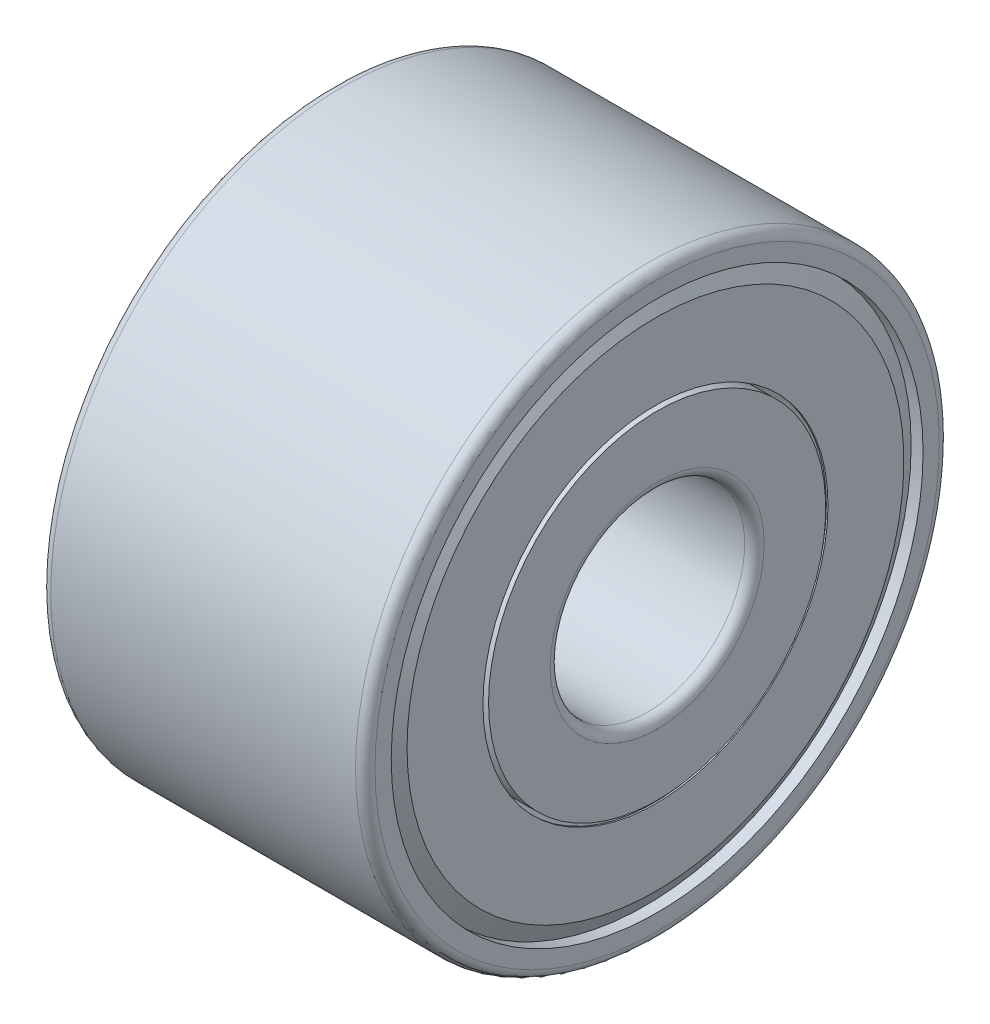
ISO-10303-21;
HEADER;
FILE_DESCRIPTION(('STEP AP214'),'2;1');
FILE_NAME('part.step','',(''),(''),'','','');
FILE_SCHEMA(('AUTOMOTIVE_DESIGN { 1 0 10303 214 1 1 1 1 }'));
ENDSEC;
DATA;
#1=APPLICATION_CONTEXT('core data for automotive mechanical design processes');
#2=APPLICATION_PROTOCOL_DEFINITION('international standard','automotive_design',2000,#1);
#3=PRODUCT_CONTEXT('',#1,'mechanical');
#4=PRODUCT('Part','Part','',(#3));
#5=PRODUCT_RELATED_PRODUCT_CATEGORY('part','',(#4));
#6=PRODUCT_DEFINITION_FORMATION('','',#4);
#7=PRODUCT_DEFINITION_CONTEXT('part definition',#1,'design');
#8=PRODUCT_DEFINITION('design','',#6,#7);
#9=PRODUCT_DEFINITION_SHAPE('','',#8);
#10=(LENGTH_UNIT() NAMED_UNIT(*) SI_UNIT(.MILLI.,.METRE.));
#11=(NAMED_UNIT(*) PLANE_ANGLE_UNIT() SI_UNIT($,.RADIAN.));
#12=(NAMED_UNIT(*) SI_UNIT($,.STERADIAN.) SOLID_ANGLE_UNIT());
#13=UNCERTAINTY_MEASURE_WITH_UNIT(LENGTH_MEASURE(1.E-05),#10,'distance_accuracy_value','');
#14=(GEOMETRIC_REPRESENTATION_CONTEXT(3) GLOBAL_UNCERTAINTY_ASSIGNED_CONTEXT((#13)) GLOBAL_UNIT_ASSIGNED_CONTEXT((#10,
#11,#12)) REPRESENTATION_CONTEXT('',''));
#15=CARTESIAN_POINT('',(0.,0.,0.));
#16=DIRECTION('',(0.,0.,1.));
#17=DIRECTION('',(1.,0.,0.));
#18=AXIS2_PLACEMENT_3D('',#15,#16,#17);
#19=CARTESIAN_POINT('',(4.,0.,0.));
#20=DIRECTION('',(-1.,0.,0.));
#21=DIRECTION('',(0.,0.,1.));
#22=AXIS2_PLACEMENT_3D('',#19,#20,#21);
#23=CYLINDRICAL_SURFACE('',#22,2.6);
#24=CARTESIAN_POINT('',(4.,0.,0.));
#25=DIRECTION('',(-1.,0.,0.));
#26=DIRECTION('',(0.,0.,1.));
#27=AXIS2_PLACEMENT_3D('',#24,#25,#26);
#28=CIRCLE('',#27,2.6);
#29=CARTESIAN_POINT('',(4.,0.,2.6));
#30=VERTEX_POINT('',#29);
#31=EDGE_CURVE('E10',#30,#30,#28,.T.);
#32=ORIENTED_EDGE('',*,*,#31,.T.);
#33=EDGE_LOOP('',(#32));
#34=FACE_BOUND('',#33,.T.);
#35=CARTESIAN_POINT('',(3.11246098558306,0.,0.));
#36=DIRECTION('',(-1.,0.,0.));
#37=DIRECTION('',(0.,0.,1.));
#38=AXIS2_PLACEMENT_3D('',#35,#36,#37);
#39=CIRCLE('',#38,2.6);
#40=CARTESIAN_POINT('',(3.11246098558306,0.,2.6));
#41=VERTEX_POINT('',#40);
#42=EDGE_CURVE('E146',#41,#41,#39,.T.);
#43=ORIENTED_EDGE('',*,*,#42,.F.);
#44=EDGE_LOOP('',(#43));
#45=FACE_BOUND('',#44,.T.);
#46=ADVANCED_FACE('F37',(#34,#45),#23,.T.);
#47=CARTESIAN_POINT('',(4.,2.6,0.));
#48=DIRECTION('',(1.,0.,0.));
#49=DIRECTION('',(0.,0.,-1.));
#50=AXIS2_PLACEMENT_3D('',#47,#48,#49);
#51=PLANE('',#50);
#52=CARTESIAN_POINT('',(4.,0.,0.));
#53=DIRECTION('',(-1.,0.,0.));
#54=DIRECTION('',(0.,0.,1.));
#55=AXIS2_PLACEMENT_3D('',#52,#53,#54);
#56=CIRCLE('',#55,1.65);
#57=CARTESIAN_POINT('',(4.,0.,1.65));
#58=VERTEX_POINT('',#57);
#59=EDGE_CURVE('E43',#58,#58,#56,.T.);
#60=ORIENTED_EDGE('',*,*,#59,.T.);
#61=EDGE_LOOP('',(#60));
#62=FACE_BOUND('',#61,.T.);
#63=ORIENTED_EDGE('',*,*,#31,.F.);
#64=EDGE_LOOP('',(#63));
#65=FACE_BOUND('',#64,.T.);
#66=ADVANCED_FACE('F155',(#62,#65),#51,.T.);
#67=CARTESIAN_POINT('',(3.85,0.,0.));
#68=DIRECTION('',(-1.,0.,0.));
#69=DIRECTION('',(0.,0.,1.));
#70=AXIS2_PLACEMENT_3D('',#67,#68,#69);
#71=TOROIDAL_SURFACE('',#70,1.65,0.15);
#72=CARTESIAN_POINT('',(3.85,0.,0.));
#73=DIRECTION('',(-1.,0.,0.));
#74=DIRECTION('',(0.,0.,1.));
#75=AXIS2_PLACEMENT_3D('',#72,#73,#74);
#76=CIRCLE('',#75,1.5);
#77=CARTESIAN_POINT('',(3.85,0.,1.5));
#78=VERTEX_POINT('',#77);
#79=EDGE_CURVE('E47',#78,#78,#76,.T.);
#80=ORIENTED_EDGE('',*,*,#79,.T.);
#81=EDGE_LOOP('',(#80));
#82=FACE_BOUND('',#81,.T.);
#83=ORIENTED_EDGE('',*,*,#59,.F.);
#84=EDGE_LOOP('',(#83));
#85=FACE_BOUND('',#84,.T.);
#86=ADVANCED_FACE('F159',(#82,#85),#71,.T.);
#87=CARTESIAN_POINT('',(4.,0.,0.));
#88=DIRECTION('',(-1.,0.,0.));
#89=DIRECTION('',(0.,0.,1.));
#90=AXIS2_PLACEMENT_3D('',#87,#88,#89);
#91=CYLINDRICAL_SURFACE('',#90,1.5);
#92=CARTESIAN_POINT('',(-0.85,0.,0.));
#93=DIRECTION('',(-1.,0.,0.));
#94=DIRECTION('',(0.,0.,1.));
#95=AXIS2_PLACEMENT_3D('',#92,#93,#94);
#96=CIRCLE('',#95,1.5);
#97=CARTESIAN_POINT('',(-0.85,0.,1.5));
#98=VERTEX_POINT('',#97);
#99=EDGE_CURVE('E51',#98,#98,#96,.T.);
#100=ORIENTED_EDGE('',*,*,#99,.T.);
#101=EDGE_LOOP('',(#100));
#102=FACE_BOUND('',#101,.T.);
#103=ORIENTED_EDGE('',*,*,#79,.F.);
#104=EDGE_LOOP('',(#103));
#105=FACE_BOUND('',#104,.T.);
#106=ADVANCED_FACE('F163',(#102,#105),#91,.F.);
#107=CARTESIAN_POINT('',(-0.85,0.,0.));
#108=DIRECTION('',(-1.,0.,0.));
#109=DIRECTION('',(0.,0.,1.));
#110=AXIS2_PLACEMENT_3D('',#107,#108,#109);
#111=TOROIDAL_SURFACE('',#110,1.65,0.15);
#112=CARTESIAN_POINT('',(-1.,0.,0.));
#113=DIRECTION('',(-1.,0.,0.));
#114=DIRECTION('',(0.,0.,1.));
#115=AXIS2_PLACEMENT_3D('',#112,#113,#114);
#116=CIRCLE('',#115,1.65);
#117=CARTESIAN_POINT('',(-1.,0.,1.65));
#118=VERTEX_POINT('',#117);
#119=EDGE_CURVE('E56',#118,#118,#116,.T.);
#120=ORIENTED_EDGE('',*,*,#119,.T.);
#121=EDGE_LOOP('',(#120));
#122=FACE_BOUND('',#121,.T.);
#123=ORIENTED_EDGE('',*,*,#99,.F.);
#124=EDGE_LOOP('',(#123));
#125=FACE_BOUND('',#124,.T.);
#126=ADVANCED_FACE('F170',(#122,#125),#111,.T.);
#127=CARTESIAN_POINT('',(-1.,2.6,0.));
#128=DIRECTION('',(-1.,0.,0.));
#129=DIRECTION('',(0.,0.,1.));
#130=AXIS2_PLACEMENT_3D('',#127,#128,#129);
#131=PLANE('',#130);
#132=CARTESIAN_POINT('',(-1.,0.,0.));
#133=DIRECTION('',(-1.,0.,0.));
#134=DIRECTION('',(0.,0.,1.));
#135=AXIS2_PLACEMENT_3D('',#132,#133,#134);
#136=CIRCLE('',#135,2.6);
#137=CARTESIAN_POINT('',(-1.,0.,2.6));
#138=VERTEX_POINT('',#137);
#139=EDGE_CURVE('E59',#138,#138,#136,.T.);
#140=ORIENTED_EDGE('',*,*,#139,.T.);
#141=EDGE_LOOP('',(#140));
#142=FACE_BOUND('',#141,.T.);
#143=ORIENTED_EDGE('',*,*,#119,.F.);
#144=EDGE_LOOP('',(#143));
#145=FACE_BOUND('',#144,.T.);
#146=ADVANCED_FACE('F174',(#142,#145),#131,.T.);
#147=CARTESIAN_POINT('',(4.,0.,0.));
#148=DIRECTION('',(-1.,0.,0.));
#149=DIRECTION('',(0.,0.,1.));
#150=AXIS2_PLACEMENT_3D('',#147,#148,#149);
#151=CYLINDRICAL_SURFACE('',#150,2.6);
#152=CARTESIAN_POINT('',(-0.112460985583064,0.,0.));
#153=DIRECTION('',(-1.,0.,0.));
#154=DIRECTION('',(0.,0.,1.));
#155=AXIS2_PLACEMENT_3D('',#152,#153,#154);
#156=CIRCLE('',#155,2.6);
#157=CARTESIAN_POINT('',(-0.112460985583064,0.,2.6));
#158=VERTEX_POINT('',#157);
#159=EDGE_CURVE('E62',#158,#158,#156,.T.);
#160=ORIENTED_EDGE('',*,*,#159,.T.);
#161=EDGE_LOOP('',(#160));
#162=FACE_BOUND('',#161,.T.);
#163=ORIENTED_EDGE('',*,*,#139,.F.);
#164=EDGE_LOOP('',(#163));
#165=FACE_BOUND('',#164,.T.);
#166=ADVANCED_FACE('F178',(#162,#165),#151,.T.);
#167=CARTESIAN_POINT('',(1.,0.,0.));
#168=DIRECTION('',(-1.,0.,0.));
#169=DIRECTION('',(0.,0.,1.));
#170=AXIS2_PLACEMENT_3D('',#167,#168,#169);
#171=TOROIDAL_SURFACE('',#170,3.35,1.34166666666667);
#172=CARTESIAN_POINT('',(-0.245017849046528,0.,0.));
#173=DIRECTION('',(-1.,0.,0.));
#174=DIRECTION('',(0.,0.,1.));
#175=AXIS2_PLACEMENT_3D('',#172,#173,#174);
#176=CIRCLE('',#175,3.85);
#177=CARTESIAN_POINT('',(-0.245017849046528,0.,3.85));
#178=VERTEX_POINT('',#177);
#179=EDGE_CURVE('E65',#178,#178,#176,.T.);
#180=ORIENTED_EDGE('',*,*,#179,.T.);
#181=EDGE_LOOP('',(#180));
#182=FACE_BOUND('',#181,.T.);
#183=ORIENTED_EDGE('',*,*,#159,.F.);
#184=EDGE_LOOP('',(#183));
#185=FACE_BOUND('',#184,.T.);
#186=ADVANCED_FACE('F182',(#182,#185),#171,.T.);
#187=CARTESIAN_POINT('',(4.,0.,0.));
#188=DIRECTION('',(-1.,0.,0.));
#189=DIRECTION('',(0.,0.,1.));
#190=AXIS2_PLACEMENT_3D('',#187,#188,#189);
#191=CYLINDRICAL_SURFACE('',#190,3.85);
#192=CARTESIAN_POINT('',(-0.636363636363635,0.,0.));
#193=DIRECTION('',(-1.,0.,0.));
#194=DIRECTION('',(0.,0.,1.));
#195=AXIS2_PLACEMENT_3D('',#192,#193,#194);
#196=CIRCLE('',#195,3.85);
#197=CARTESIAN_POINT('',(-0.636363636363635,0.,3.85));
#198=VERTEX_POINT('',#197);
#199=EDGE_CURVE('E68',#198,#198,#196,.T.);
#200=ORIENTED_EDGE('',*,*,#199,.T.);
#201=EDGE_LOOP('',(#200));
#202=FACE_BOUND('',#201,.T.);
#203=ORIENTED_EDGE('',*,*,#179,.F.);
#204=EDGE_LOOP('',(#203));
#205=FACE_BOUND('',#204,.T.);
#206=ADVANCED_FACE('F186',(#202,#205),#191,.F.);
#207=CARTESIAN_POINT('',(-0.63636363636363,4.09999999999993,0.));
#208=DIRECTION('',(-1.,0.,0.));
#209=DIRECTION('',(0.,0.,1.));
#210=AXIS2_PLACEMENT_3D('',#207,#208,#209);
#211=PLANE('',#210);
#212=CARTESIAN_POINT('',(-0.636363636363626,0.,0.));
#213=DIRECTION('',(-1.,0.,0.));
#214=DIRECTION('',(0.,0.,1.));
#215=AXIS2_PLACEMENT_3D('',#212,#213,#214);
#216=CIRCLE('',#215,4.09999999999993);
#217=CARTESIAN_POINT('',(-0.636363636363626,0.,4.09999999999993));
#218=VERTEX_POINT('',#217);
#219=EDGE_CURVE('E71',#218,#218,#216,.T.);
#220=ORIENTED_EDGE('',*,*,#219,.T.);
#221=EDGE_LOOP('',(#220));
#222=FACE_BOUND('',#221,.T.);
#223=ORIENTED_EDGE('',*,*,#199,.F.);
#224=EDGE_LOOP('',(#223));
#225=FACE_BOUND('',#224,.T.);
#226=ADVANCED_FACE('F190',(#222,#225),#211,.T.);
#227=CARTESIAN_POINT('',(-0.727272727272719,0.,0.));
#228=DIRECTION('',(-1.,0.,0.));
#229=DIRECTION('',(0.,0.,1.));
#230=AXIS2_PLACEMENT_3D('',#227,#228,#229);
#231=TOROIDAL_SURFACE('',#230,4.09999999999993,0.0909090909090932);
#232=CARTESIAN_POINT('',(-0.740980147437955,0.,0.));
#233=DIRECTION('',(-1.,0.,0.));
#234=DIRECTION('',(0.,0.,1.));
#235=AXIS2_PLACEMENT_3D('',#232,#233,#234);
#236=CIRCLE('',#235,4.18986973596444);
#237=CARTESIAN_POINT('',(-0.740980147437955,0.,4.18986973596444));
#238=VERTEX_POINT('',#237);
#239=EDGE_CURVE('E74',#238,#238,#236,.T.);
#240=ORIENTED_EDGE('',*,*,#239,.T.);
#241=EDGE_LOOP('',(#240));
#242=FACE_BOUND('',#241,.T.);
#243=ORIENTED_EDGE('',*,*,#219,.F.);
#244=EDGE_LOOP('',(#243));
#245=FACE_BOUND('',#244,.T.);
#246=ADVANCED_FACE('F194',(#242,#245),#231,.F.);
#247=CARTESIAN_POINT('',(-0.740980147437955,0.,0.));
#248=DIRECTION('',(-1.,0.,0.));
#249=DIRECTION('',(0.,0.,1.));
#250=AXIS2_PLACEMENT_3D('',#247,#248,#249);
#251=CONICAL_SURFACE('',#250,4.18986973596444,0.523598775598685);
#252=CARTESIAN_POINT('',(-0.738174682452694,0.,0.));
#253=DIRECTION('',(-1.,0.,0.));
#254=DIRECTION('',(0.,0.,1.));
#255=AXIS2_PLACEMENT_3D('',#252,#253,#254);
#256=CIRCLE('',#255,4.18825);
#257=CARTESIAN_POINT('',(-0.738174682452694,0.,4.18825));
#258=VERTEX_POINT('',#257);
#259=EDGE_CURVE('E77',#258,#258,#256,.T.);
#260=ORIENTED_EDGE('',*,*,#259,.T.);
#261=EDGE_LOOP('',(#260));
#262=FACE_BOUND('',#261,.T.);
#263=ORIENTED_EDGE('',*,*,#239,.F.);
#264=EDGE_LOOP('',(#263));
#265=FACE_BOUND('',#264,.T.);
#266=ADVANCED_FACE('F198',(#262,#265),#251,.T.);
#267=CARTESIAN_POINT('',(-0.738174682452694,0.,0.));
#268=DIRECTION('',(1.,0.,0.));
#269=DIRECTION('',(0.,0.,-1.));
#270=AXIS2_PLACEMENT_3D('',#267,#268,#269);
#271=CONICAL_SURFACE('',#270,4.18825,1.0471975511966);
#272=CARTESIAN_POINT('',(-0.949,0.,0.));
#273=DIRECTION('',(-1.,0.,0.));
#274=DIRECTION('',(0.,0.,1.));
#275=AXIS2_PLACEMENT_3D('',#272,#273,#274);
#276=CIRCLE('',#275,3.82308983848623);
#277=CARTESIAN_POINT('',(-0.949,0.,3.82308983848623));
#278=VERTEX_POINT('',#277);
#279=EDGE_CURVE('E80',#278,#278,#276,.T.);
#280=ORIENTED_EDGE('',*,*,#279,.T.);
#281=EDGE_LOOP('',(#280));
#282=FACE_BOUND('',#281,.T.);
#283=ORIENTED_EDGE('',*,*,#259,.F.);
#284=EDGE_LOOP('',(#283));
#285=FACE_BOUND('',#284,.T.);
#286=ADVANCED_FACE('F202',(#282,#285),#271,.F.);
#287=CARTESIAN_POINT('',(-0.949,2.65999999999992,0.));
#288=DIRECTION('',(1.,0.,0.));
#289=DIRECTION('',(0.,0.,-1.));
#290=AXIS2_PLACEMENT_3D('',#287,#288,#289);
#291=PLANE('',#290);
#292=CARTESIAN_POINT('',(-0.948999999999999,0.,0.));
#293=DIRECTION('',(-1.,0.,0.));
#294=DIRECTION('',(0.,0.,1.));
#295=AXIS2_PLACEMENT_3D('',#292,#293,#294);
#296=CIRCLE('',#295,2.65999999999992);
#297=CARTESIAN_POINT('',(-0.948999999999999,0.,2.65999999999992));
#298=VERTEX_POINT('',#297);
#299=EDGE_CURVE('E83',#298,#298,#296,.T.);
#300=ORIENTED_EDGE('',*,*,#299,.T.);
#301=EDGE_LOOP('',(#300));
#302=FACE_BOUND('',#301,.T.);
#303=ORIENTED_EDGE('',*,*,#279,.F.);
#304=EDGE_LOOP('',(#303));
#305=FACE_BOUND('',#304,.T.);
#306=ADVANCED_FACE('F206',(#302,#305),#291,.T.);
#307=CARTESIAN_POINT('',(4.,0.,0.));
#308=DIRECTION('',(-1.,0.,0.));
#309=DIRECTION('',(0.,0.,1.));
#310=AXIS2_PLACEMENT_3D('',#307,#308,#309);
#311=CYLINDRICAL_SURFACE('',#310,2.65999999999992);
#312=CARTESIAN_POINT('',(-0.973999999999983,0.,0.));
#313=DIRECTION('',(-1.,0.,0.));
#314=DIRECTION('',(0.,0.,1.));
#315=AXIS2_PLACEMENT_3D('',#312,#313,#314);
#316=CIRCLE('',#315,2.65999999999992);
#317=CARTESIAN_POINT('',(-0.973999999999983,0.,2.65999999999992));
#318=VERTEX_POINT('',#317);
#319=EDGE_CURVE('E86',#318,#318,#316,.T.);
#320=ORIENTED_EDGE('',*,*,#319,.T.);
#321=EDGE_LOOP('',(#320));
#322=FACE_BOUND('',#321,.T.);
#323=ORIENTED_EDGE('',*,*,#299,.F.);
#324=EDGE_LOOP('',(#323));
#325=FACE_BOUND('',#324,.T.);
#326=ADVANCED_FACE('F210',(#322,#325),#311,.F.);
#327=CARTESIAN_POINT('',(-0.973999999999983,3.82978856829693,0.));
#328=DIRECTION('',(-1.,0.,0.));
#329=DIRECTION('',(0.,0.,1.));
#330=AXIS2_PLACEMENT_3D('',#327,#328,#329);
#331=PLANE('',#330);
#332=CARTESIAN_POINT('',(-0.973999999999983,0.,0.));
#333=DIRECTION('',(-1.,0.,0.));
#334=DIRECTION('',(0.,0.,1.));
#335=AXIS2_PLACEMENT_3D('',#332,#333,#334);
#336=CIRCLE('',#335,3.82978856829693);
#337=CARTESIAN_POINT('',(-0.973999999999983,0.,3.82978856829693));
#338=VERTEX_POINT('',#337);
#339=EDGE_CURVE('E89',#338,#338,#336,.T.);
#340=ORIENTED_EDGE('',*,*,#339,.T.);
#341=EDGE_LOOP('',(#340));
#342=FACE_BOUND('',#341,.T.);
#343=ORIENTED_EDGE('',*,*,#319,.F.);
#344=EDGE_LOOP('',(#343));
#345=FACE_BOUND('',#344,.T.);
#346=ADVANCED_FACE('F214',(#342,#345),#331,.T.);
#347=CARTESIAN_POINT('',(-0.973999999999983,0.,0.));
#348=DIRECTION('',(1.,0.,0.));
#349=DIRECTION('',(0.,0.,-1.));
#350=AXIS2_PLACEMENT_3D('',#347,#348,#349);
#351=CONICAL_SURFACE('',#350,3.82978856829693,1.04117434780133);
#352=CARTESIAN_POINT('',(-0.81581570684173,0.,0.));
#353=DIRECTION('',(-1.,0.,0.));
#354=DIRECTION('',(0.,0.,1.));
#355=AXIS2_PLACEMENT_3D('',#352,#353,#354);
#356=CIRCLE('',#355,4.09999999999993);
#357=CARTESIAN_POINT('',(-0.81581570684173,0.,4.09999999999993));
#358=VERTEX_POINT('',#357);
#359=EDGE_CURVE('E92',#358,#358,#356,.T.);
#360=ORIENTED_EDGE('',*,*,#359,.T.);
#361=EDGE_LOOP('',(#360));
#362=FACE_BOUND('',#361,.T.);
#363=ORIENTED_EDGE('',*,*,#339,.F.);
#364=EDGE_LOOP('',(#363));
#365=FACE_BOUND('',#364,.T.);
#366=ADVANCED_FACE('F218',(#362,#365),#351,.T.);
#367=CARTESIAN_POINT('',(4.,0.,0.));
#368=DIRECTION('',(-1.,0.,0.));
#369=DIRECTION('',(0.,0.,1.));
#370=AXIS2_PLACEMENT_3D('',#367,#368,#369);
#371=CYLINDRICAL_SURFACE('',#370,4.09999999999993);
#372=CARTESIAN_POINT('',(-1.,0.,0.));
#373=DIRECTION('',(-1.,0.,0.));
#374=DIRECTION('',(0.,0.,1.));
#375=AXIS2_PLACEMENT_3D('',#372,#373,#374);
#376=CIRCLE('',#375,4.09999999999993);
#377=CARTESIAN_POINT('',(-1.,0.,4.09999999999993));
#378=VERTEX_POINT('',#377);
#379=EDGE_CURVE('E95',#378,#378,#376,.T.);
#380=ORIENTED_EDGE('',*,*,#379,.T.);
#381=EDGE_LOOP('',(#380));
#382=FACE_BOUND('',#381,.T.);
#383=ORIENTED_EDGE('',*,*,#359,.F.);
#384=EDGE_LOOP('',(#383));
#385=FACE_BOUND('',#384,.T.);
#386=ADVANCED_FACE('F222',(#382,#385),#371,.F.);
#387=CARTESIAN_POINT('',(-1.,4.35,0.));
#388=DIRECTION('',(-1.,0.,0.));
#389=DIRECTION('',(0.,0.,1.));
#390=AXIS2_PLACEMENT_3D('',#387,#388,#389);
#391=PLANE('',#390);
#392=CARTESIAN_POINT('',(-1.,0.,0.));
#393=DIRECTION('',(-1.,0.,0.));
#394=DIRECTION('',(0.,0.,1.));
#395=AXIS2_PLACEMENT_3D('',#392,#393,#394);
#396=CIRCLE('',#395,4.35);
#397=CARTESIAN_POINT('',(-1.,0.,4.35));
#398=VERTEX_POINT('',#397);
#399=EDGE_CURVE('E98',#398,#398,#396,.T.);
#400=ORIENTED_EDGE('',*,*,#399,.T.);
#401=EDGE_LOOP('',(#400));
#402=FACE_BOUND('',#401,.T.);
#403=ORIENTED_EDGE('',*,*,#379,.F.);
#404=EDGE_LOOP('',(#403));
#405=FACE_BOUND('',#404,.T.);
#406=ADVANCED_FACE('F226',(#402,#405),#391,.T.);
#407=CARTESIAN_POINT('',(-0.85,0.,0.));
#408=DIRECTION('',(-1.,0.,0.));
#409=DIRECTION('',(0.,0.,1.));
#410=AXIS2_PLACEMENT_3D('',#407,#408,#409);
#411=TOROIDAL_SURFACE('',#410,4.35,0.15);
#412=CARTESIAN_POINT('',(-0.85,0.,0.));
#413=DIRECTION('',(-1.,0.,0.));
#414=DIRECTION('',(0.,0.,1.));
#415=AXIS2_PLACEMENT_3D('',#412,#413,#414);
#416=CIRCLE('',#415,4.5);
#417=CARTESIAN_POINT('',(-0.85,0.,4.5));
#418=VERTEX_POINT('',#417);
#419=EDGE_CURVE('E101',#418,#418,#416,.T.);
#420=ORIENTED_EDGE('',*,*,#419,.T.);
#421=EDGE_LOOP('',(#420));
#422=FACE_BOUND('',#421,.T.);
#423=ORIENTED_EDGE('',*,*,#399,.F.);
#424=EDGE_LOOP('',(#423));
#425=FACE_BOUND('',#424,.T.);
#426=ADVANCED_FACE('F230',(#422,#425),#411,.T.);
#427=CARTESIAN_POINT('',(4.,0.,0.));
#428=DIRECTION('',(-1.,0.,0.));
#429=DIRECTION('',(0.,0.,1.));
#430=AXIS2_PLACEMENT_3D('',#427,#428,#429);
#431=CYLINDRICAL_SURFACE('',#430,4.5);
#432=CARTESIAN_POINT('',(3.85,0.,0.));
#433=DIRECTION('',(-1.,0.,0.));
#434=DIRECTION('',(0.,0.,1.));
#435=AXIS2_PLACEMENT_3D('',#432,#433,#434);
#436=CIRCLE('',#435,4.5);
#437=CARTESIAN_POINT('',(3.85,0.,4.5));
#438=VERTEX_POINT('',#437);
#439=EDGE_CURVE('E104',#438,#438,#436,.T.);
#440=ORIENTED_EDGE('',*,*,#439,.T.);
#441=EDGE_LOOP('',(#440));
#442=FACE_BOUND('',#441,.T.);
#443=ORIENTED_EDGE('',*,*,#419,.F.);
#444=EDGE_LOOP('',(#443));
#445=FACE_BOUND('',#444,.T.);
#446=ADVANCED_FACE('F234',(#442,#445),#431,.T.);
#447=CARTESIAN_POINT('',(3.85,0.,0.));
#448=DIRECTION('',(-1.,0.,0.));
#449=DIRECTION('',(0.,0.,1.));
#450=AXIS2_PLACEMENT_3D('',#447,#448,#449);
#451=TOROIDAL_SURFACE('',#450,4.35,0.15);
#452=CARTESIAN_POINT('',(4.,0.,0.));
#453=DIRECTION('',(-1.,0.,0.));
#454=DIRECTION('',(0.,0.,1.));
#455=AXIS2_PLACEMENT_3D('',#452,#453,#454);
#456=CIRCLE('',#455,4.35);
#457=CARTESIAN_POINT('',(4.,0.,4.35));
#458=VERTEX_POINT('',#457);
#459=EDGE_CURVE('E107',#458,#458,#456,.T.);
#460=ORIENTED_EDGE('',*,*,#459,.T.);
#461=EDGE_LOOP('',(#460));
#462=FACE_BOUND('',#461,.T.);
#463=ORIENTED_EDGE('',*,*,#439,.F.);
#464=EDGE_LOOP('',(#463));
#465=FACE_BOUND('',#464,.T.);
#466=ADVANCED_FACE('F238',(#462,#465),#451,.T.);
#467=CARTESIAN_POINT('',(4.,4.35,0.));
#468=DIRECTION('',(1.,0.,0.));
#469=DIRECTION('',(0.,0.,-1.));
#470=AXIS2_PLACEMENT_3D('',#467,#468,#469);
#471=PLANE('',#470);
#472=CARTESIAN_POINT('',(4.,0.,0.));
#473=DIRECTION('',(-1.,0.,0.));
#474=DIRECTION('',(0.,0.,1.));
#475=AXIS2_PLACEMENT_3D('',#472,#473,#474);
#476=CIRCLE('',#475,4.09999999999993);
#477=CARTESIAN_POINT('',(4.,0.,4.09999999999993));
#478=VERTEX_POINT('',#477);
#479=EDGE_CURVE('E110',#478,#478,#476,.T.);
#480=ORIENTED_EDGE('',*,*,#479,.T.);
#481=EDGE_LOOP('',(#480));
#482=FACE_BOUND('',#481,.T.);
#483=ORIENTED_EDGE('',*,*,#459,.F.);
#484=EDGE_LOOP('',(#483));
#485=FACE_BOUND('',#484,.T.);
#486=ADVANCED_FACE('F242',(#482,#485),#471,.T.);
#487=CARTESIAN_POINT('',(4.,0.,0.));
#488=DIRECTION('',(-1.,0.,0.));
#489=DIRECTION('',(0.,0.,1.));
#490=AXIS2_PLACEMENT_3D('',#487,#488,#489);
#491=CYLINDRICAL_SURFACE('',#490,4.09999999999993);
#492=CARTESIAN_POINT('',(3.81581570684173,0.,0.));
#493=DIRECTION('',(-1.,0.,0.));
#494=DIRECTION('',(0.,0.,1.));
#495=AXIS2_PLACEMENT_3D('',#492,#493,#494);
#496=CIRCLE('',#495,4.09999999999993);
#497=CARTESIAN_POINT('',(3.81581570684173,0.,4.09999999999993));
#498=VERTEX_POINT('',#497);
#499=EDGE_CURVE('E113',#498,#498,#496,.T.);
#500=ORIENTED_EDGE('',*,*,#499,.T.);
#501=EDGE_LOOP('',(#500));
#502=FACE_BOUND('',#501,.T.);
#503=ORIENTED_EDGE('',*,*,#479,.F.);
#504=EDGE_LOOP('',(#503));
#505=FACE_BOUND('',#504,.T.);
#506=ADVANCED_FACE('F246',(#502,#505),#491,.F.);
#507=CARTESIAN_POINT('',(3.81581570684173,0.,0.));
#508=DIRECTION('',(-1.,0.,0.));
#509=DIRECTION('',(0.,0.,1.));
#510=AXIS2_PLACEMENT_3D('',#507,#508,#509);
#511=CONICAL_SURFACE('',#510,4.09999999999993,1.04117434780133);
#512=CARTESIAN_POINT('',(3.97399999999998,0.,0.));
#513=DIRECTION('',(-1.,0.,0.));
#514=DIRECTION('',(0.,0.,1.));
#515=AXIS2_PLACEMENT_3D('',#512,#513,#514);
#516=CIRCLE('',#515,3.82978856829693);
#517=CARTESIAN_POINT('',(3.97399999999998,0.,3.82978856829693));
#518=VERTEX_POINT('',#517);
#519=EDGE_CURVE('E116',#518,#518,#516,.T.);
#520=ORIENTED_EDGE('',*,*,#519,.T.);
#521=EDGE_LOOP('',(#520));
#522=FACE_BOUND('',#521,.T.);
#523=ORIENTED_EDGE('',*,*,#499,.F.);
#524=EDGE_LOOP('',(#523));
#525=FACE_BOUND('',#524,.T.);
#526=ADVANCED_FACE('F250',(#522,#525),#511,.T.);
#527=CARTESIAN_POINT('',(3.97399999999998,3.82978856829693,0.));
#528=DIRECTION('',(1.,0.,0.));
#529=DIRECTION('',(0.,0.,-1.));
#530=AXIS2_PLACEMENT_3D('',#527,#528,#529);
#531=PLANE('',#530);
#532=CARTESIAN_POINT('',(3.97399999999998,0.,0.));
#533=DIRECTION('',(-1.,0.,0.));
#534=DIRECTION('',(0.,0.,1.));
#535=AXIS2_PLACEMENT_3D('',#532,#533,#534);
#536=CIRCLE('',#535,2.65999999999992);
#537=CARTESIAN_POINT('',(3.97399999999998,0.,2.65999999999992));
#538=VERTEX_POINT('',#537);
#539=EDGE_CURVE('E119',#538,#538,#536,.T.);
#540=ORIENTED_EDGE('',*,*,#539,.T.);
#541=EDGE_LOOP('',(#540));
#542=FACE_BOUND('',#541,.T.);
#543=ORIENTED_EDGE('',*,*,#519,.F.);
#544=EDGE_LOOP('',(#543));
#545=FACE_BOUND('',#544,.T.);
#546=ADVANCED_FACE('F254',(#542,#545),#531,.T.);
#547=CARTESIAN_POINT('',(4.,0.,0.));
#548=DIRECTION('',(-1.,0.,0.));
#549=DIRECTION('',(0.,0.,1.));
#550=AXIS2_PLACEMENT_3D('',#547,#548,#549);
#551=CYLINDRICAL_SURFACE('',#550,2.65999999999992);
#552=CARTESIAN_POINT('',(3.949,0.,0.));
#553=DIRECTION('',(-1.,0.,0.));
#554=DIRECTION('',(0.,0.,1.));
#555=AXIS2_PLACEMENT_3D('',#552,#553,#554);
#556=CIRCLE('',#555,2.65999999999992);
#557=CARTESIAN_POINT('',(3.949,0.,2.65999999999992));
#558=VERTEX_POINT('',#557);
#559=EDGE_CURVE('E122',#558,#558,#556,.T.);
#560=ORIENTED_EDGE('',*,*,#559,.T.);
#561=EDGE_LOOP('',(#560));
#562=FACE_BOUND('',#561,.T.);
#563=ORIENTED_EDGE('',*,*,#539,.F.);
#564=EDGE_LOOP('',(#563));
#565=FACE_BOUND('',#564,.T.);
#566=ADVANCED_FACE('F258',(#562,#565),#551,.F.);
#567=CARTESIAN_POINT('',(3.949,2.65999999999992,0.));
#568=DIRECTION('',(-1.,0.,0.));
#569=DIRECTION('',(0.,0.,1.));
#570=AXIS2_PLACEMENT_3D('',#567,#568,#569);
#571=PLANE('',#570);
#572=CARTESIAN_POINT('',(3.949,0.,0.));
#573=DIRECTION('',(-1.,0.,0.));
#574=DIRECTION('',(0.,0.,1.));
#575=AXIS2_PLACEMENT_3D('',#572,#573,#574);
#576=CIRCLE('',#575,3.82308983848623);
#577=CARTESIAN_POINT('',(3.949,0.,3.82308983848623));
#578=VERTEX_POINT('',#577);
#579=EDGE_CURVE('E125',#578,#578,#576,.T.);
#580=ORIENTED_EDGE('',*,*,#579,.T.);
#581=EDGE_LOOP('',(#580));
#582=FACE_BOUND('',#581,.T.);
#583=ORIENTED_EDGE('',*,*,#559,.F.);
#584=EDGE_LOOP('',(#583));
#585=FACE_BOUND('',#584,.T.);
#586=ADVANCED_FACE('F262',(#582,#585),#571,.T.);
#587=CARTESIAN_POINT('',(3.949,0.,0.));
#588=DIRECTION('',(-1.,0.,0.));
#589=DIRECTION('',(0.,0.,1.));
#590=AXIS2_PLACEMENT_3D('',#587,#588,#589);
#591=CONICAL_SURFACE('',#590,3.82308983848623,1.0471975511966);
#592=CARTESIAN_POINT('',(3.7381746824527,0.,0.));
#593=DIRECTION('',(-1.,0.,0.));
#594=DIRECTION('',(0.,0.,1.));
#595=AXIS2_PLACEMENT_3D('',#592,#593,#594);
#596=CIRCLE('',#595,4.18825);
#597=CARTESIAN_POINT('',(3.7381746824527,0.,4.18825));
#598=VERTEX_POINT('',#597);
#599=EDGE_CURVE('E128',#598,#598,#596,.T.);
#600=ORIENTED_EDGE('',*,*,#599,.T.);
#601=EDGE_LOOP('',(#600));
#602=FACE_BOUND('',#601,.T.);
#603=ORIENTED_EDGE('',*,*,#579,.F.);
#604=EDGE_LOOP('',(#603));
#605=FACE_BOUND('',#604,.T.);
#606=ADVANCED_FACE('F266',(#602,#605),#591,.F.);
#607=CARTESIAN_POINT('',(3.7381746824527,0.,0.));
#608=DIRECTION('',(1.,0.,0.));
#609=DIRECTION('',(0.,0.,-1.));
#610=AXIS2_PLACEMENT_3D('',#607,#608,#609);
#611=CONICAL_SURFACE('',#610,4.18825,0.52359877559852);
#612=CARTESIAN_POINT('',(3.74098014743795,0.,0.));
#613=DIRECTION('',(-1.,0.,0.));
#614=DIRECTION('',(0.,0.,1.));
#615=AXIS2_PLACEMENT_3D('',#612,#613,#614);
#616=CIRCLE('',#615,4.18986973596444);
#617=CARTESIAN_POINT('',(3.74098014743795,0.,4.18986973596444));
#618=VERTEX_POINT('',#617);
#619=EDGE_CURVE('E131',#618,#618,#616,.T.);
#620=ORIENTED_EDGE('',*,*,#619,.T.);
#621=EDGE_LOOP('',(#620));
#622=FACE_BOUND('',#621,.T.);
#623=ORIENTED_EDGE('',*,*,#599,.F.);
#624=EDGE_LOOP('',(#623));
#625=FACE_BOUND('',#624,.T.);
#626=ADVANCED_FACE('F270',(#622,#625),#611,.T.);
#627=CARTESIAN_POINT('',(3.72727272727272,0.,0.));
#628=DIRECTION('',(-1.,0.,0.));
#629=DIRECTION('',(0.,0.,1.));
#630=AXIS2_PLACEMENT_3D('',#627,#628,#629);
#631=TOROIDAL_SURFACE('',#630,4.09999999999993,0.0909090909090932);
#632=CARTESIAN_POINT('',(3.63636363636363,0.,0.));
#633=DIRECTION('',(-1.,0.,0.));
#634=DIRECTION('',(0.,0.,1.));
#635=AXIS2_PLACEMENT_3D('',#632,#633,#634);
#636=CIRCLE('',#635,4.09999999999993);
#637=CARTESIAN_POINT('',(3.63636363636363,0.,4.09999999999993));
#638=VERTEX_POINT('',#637);
#639=EDGE_CURVE('E134',#638,#638,#636,.T.);
#640=ORIENTED_EDGE('',*,*,#639,.T.);
#641=EDGE_LOOP('',(#640));
#642=FACE_BOUND('',#641,.T.);
#643=ORIENTED_EDGE('',*,*,#619,.F.);
#644=EDGE_LOOP('',(#643));
#645=FACE_BOUND('',#644,.T.);
#646=ADVANCED_FACE('F274',(#642,#645),#631,.F.);
#647=CARTESIAN_POINT('',(3.63636363636363,4.09999999999993,0.));
#648=DIRECTION('',(1.,0.,0.));
#649=DIRECTION('',(0.,0.,-1.));
#650=AXIS2_PLACEMENT_3D('',#647,#648,#649);
#651=PLANE('',#650);
#652=CARTESIAN_POINT('',(3.63636363636363,0.,0.));
#653=DIRECTION('',(-1.,0.,0.));
#654=DIRECTION('',(0.,0.,1.));
#655=AXIS2_PLACEMENT_3D('',#652,#653,#654);
#656=CIRCLE('',#655,3.85);
#657=CARTESIAN_POINT('',(3.63636363636363,0.,3.85));
#658=VERTEX_POINT('',#657);
#659=EDGE_CURVE('E138',#658,#658,#656,.T.);
#660=ORIENTED_EDGE('',*,*,#659,.T.);
#661=EDGE_LOOP('',(#660));
#662=FACE_BOUND('',#661,.T.);
#663=ORIENTED_EDGE('',*,*,#639,.F.);
#664=EDGE_LOOP('',(#663));
#665=FACE_BOUND('',#664,.T.);
#666=ADVANCED_FACE('F278',(#662,#665),#651,.T.);
#667=CARTESIAN_POINT('',(4.,0.,0.));
#668=DIRECTION('',(-1.,0.,0.));
#669=DIRECTION('',(0.,0.,1.));
#670=AXIS2_PLACEMENT_3D('',#667,#668,#669);
#671=CYLINDRICAL_SURFACE('',#670,3.85);
#672=CARTESIAN_POINT('',(3.24501784904653,0.,0.));
#673=DIRECTION('',(-1.,0.,0.));
#674=DIRECTION('',(0.,0.,1.));
#675=AXIS2_PLACEMENT_3D('',#672,#673,#674);
#676=CIRCLE('',#675,3.85);
#677=CARTESIAN_POINT('',(3.24501784904653,0.,3.85));
#678=VERTEX_POINT('',#677);
#679=EDGE_CURVE('E142',#678,#678,#676,.T.);
#680=ORIENTED_EDGE('',*,*,#679,.T.);
#681=EDGE_LOOP('',(#680));
#682=FACE_BOUND('',#681,.T.);
#683=ORIENTED_EDGE('',*,*,#659,.F.);
#684=EDGE_LOOP('',(#683));
#685=FACE_BOUND('',#684,.T.);
#686=ADVANCED_FACE('F282',(#682,#685),#671,.F.);
#687=CARTESIAN_POINT('',(2.,0.,0.));
#688=DIRECTION('',(-1.,0.,0.));
#689=DIRECTION('',(0.,0.,1.));
#690=AXIS2_PLACEMENT_3D('',#687,#688,#689);
#691=TOROIDAL_SURFACE('',#690,3.35,1.34166666666667);
#692=ORIENTED_EDGE('',*,*,#42,.T.);
#693=EDGE_LOOP('',(#692));
#694=FACE_BOUND('',#693,.T.);
#695=ORIENTED_EDGE('',*,*,#679,.F.);
#696=EDGE_LOOP('',(#695));
#697=FACE_BOUND('',#696,.T.);
#698=ADVANCED_FACE('F151',(#694,#697),#691,.T.);
#699=CLOSED_SHELL('',(#46,#66,#86,#106,#126,#146,#166,#186,#206,#226,#246,#266,#286,#306,#326,
#346,#366,#386,#406,#426,#446,#466,#486,#506,#526,#546,#566,#586,#606,#626,#646,#666,#686,#698));
#700=MANIFOLD_SOLID_BREP('B2',#699);
#701=ADVANCED_BREP_SHAPE_REPRESENTATION('',(#18,#700),#14);
#702=SHAPE_DEFINITION_REPRESENTATION(#9,#701);
ENDSEC;
END-ISO-10303-21;
